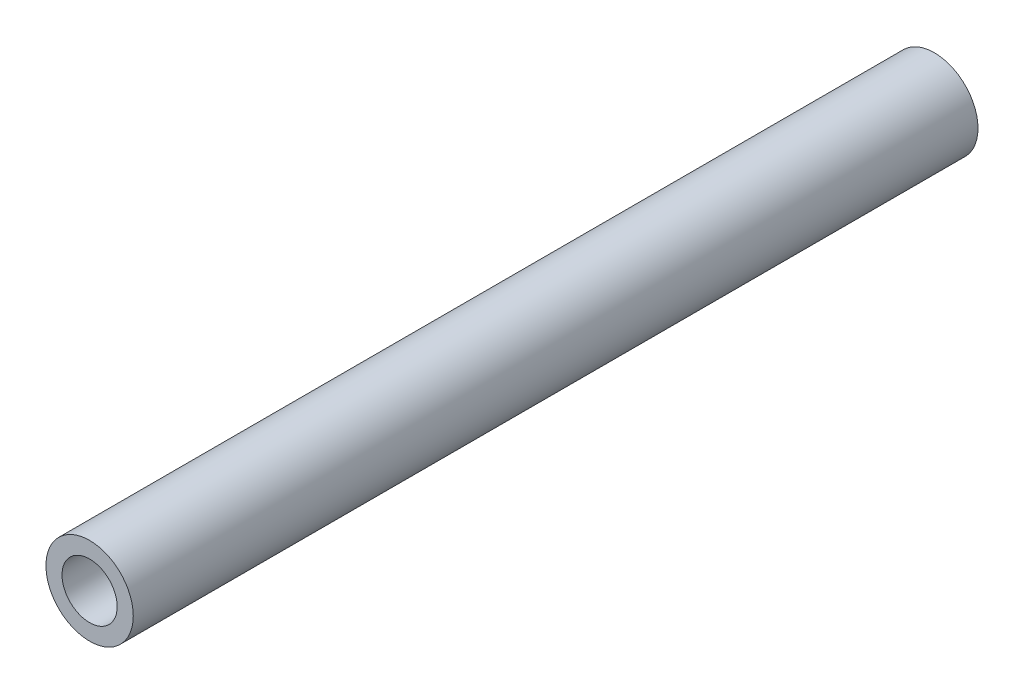
ISO-10303-21;
HEADER;
FILE_DESCRIPTION(('STEP AP214'),'2;1');
FILE_NAME('part.step','',(''),(''),'','','');
FILE_SCHEMA(('AUTOMOTIVE_DESIGN { 1 0 10303 214 1 1 1 1 }'));
ENDSEC;
DATA;
#1=APPLICATION_CONTEXT('core data for automotive mechanical design processes');
#2=APPLICATION_PROTOCOL_DEFINITION('international standard','automotive_design',2000,#1);
#3=PRODUCT_CONTEXT('',#1,'mechanical');
#4=PRODUCT('Part','Part','',(#3));
#5=PRODUCT_RELATED_PRODUCT_CATEGORY('part','',(#4));
#6=PRODUCT_DEFINITION_FORMATION('','',#4);
#7=PRODUCT_DEFINITION_CONTEXT('part definition',#1,'design');
#8=PRODUCT_DEFINITION('design','',#6,#7);
#9=PRODUCT_DEFINITION_SHAPE('','',#8);
#10=(LENGTH_UNIT() NAMED_UNIT(*) SI_UNIT(.MILLI.,.METRE.));
#11=(NAMED_UNIT(*) PLANE_ANGLE_UNIT() SI_UNIT($,.RADIAN.));
#12=(NAMED_UNIT(*) SI_UNIT($,.STERADIAN.) SOLID_ANGLE_UNIT());
#13=UNCERTAINTY_MEASURE_WITH_UNIT(LENGTH_MEASURE(1.E-05),#10,'distance_accuracy_value','');
#14=(GEOMETRIC_REPRESENTATION_CONTEXT(3) GLOBAL_UNCERTAINTY_ASSIGNED_CONTEXT((#13)) GLOBAL_UNIT_ASSIGNED_CONTEXT((#10,
#11,#12)) REPRESENTATION_CONTEXT('',''));
#15=CARTESIAN_POINT('',(0.,0.,0.));
#16=DIRECTION('',(0.,0.,1.));
#17=DIRECTION('',(1.,0.,0.));
#18=AXIS2_PLACEMENT_3D('',#15,#16,#17);
#19=CARTESIAN_POINT('',(0.,0.,233.3625));
#20=DIRECTION('',(0.,0.,1.));
#21=DIRECTION('',(1.,0.,0.));
#22=AXIS2_PLACEMENT_3D('',#19,#20,#21);
#23=PLANE('',#22);
#24=CARTESIAN_POINT('',(0.,0.,233.3625));
#25=DIRECTION('',(0.,0.,1.));
#26=DIRECTION('',(1.,0.,0.));
#27=AXIS2_PLACEMENT_3D('',#24,#25,#26);
#28=CIRCLE('',#27,24.13);
#29=CARTESIAN_POINT('',(24.13,0.,233.3625));
#30=VERTEX_POINT('',#29);
#31=EDGE_CURVE('E10',#30,#30,#28,.T.);
#32=ORIENTED_EDGE('',*,*,#31,.T.);
#33=EDGE_LOOP('',(#32));
#34=FACE_BOUND('',#33,.T.);
#35=CARTESIAN_POINT('',(0.,0.,233.3625));
#36=DIRECTION('',(0.,0.,1.));
#37=DIRECTION('',(1.,0.,0.));
#38=AXIS2_PLACEMENT_3D('',#35,#36,#37);
#39=CIRCLE('',#38,15.24);
#40=CARTESIAN_POINT('',(15.24,0.,233.3625));
#41=VERTEX_POINT('',#40);
#42=EDGE_CURVE('E42',#41,#41,#39,.T.);
#43=ORIENTED_EDGE('',*,*,#42,.F.);
#44=EDGE_LOOP('',(#43));
#45=FACE_BOUND('',#44,.T.);
#46=ADVANCED_FACE('F31',(#34,#45),#23,.T.);
#47=CARTESIAN_POINT('',(0.,0.,-233.3625));
#48=DIRECTION('',(0.,0.,1.));
#49=DIRECTION('',(1.,0.,0.));
#50=AXIS2_PLACEMENT_3D('',#47,#48,#49);
#51=PLANE('',#50);
#52=CARTESIAN_POINT('',(0.,0.,-233.3625));
#53=DIRECTION('',(0.,0.,1.));
#54=DIRECTION('',(1.,0.,0.));
#55=AXIS2_PLACEMENT_3D('',#52,#53,#54);
#56=CIRCLE('',#55,24.13);
#57=CARTESIAN_POINT('',(24.13,0.,-233.3625));
#58=VERTEX_POINT('',#57);
#59=EDGE_CURVE('E35',#58,#58,#56,.T.);
#60=ORIENTED_EDGE('',*,*,#59,.F.);
#61=EDGE_LOOP('',(#60));
#62=FACE_BOUND('',#61,.T.);
#63=CARTESIAN_POINT('',(0.,0.,-233.3625));
#64=DIRECTION('',(0.,0.,1.));
#65=DIRECTION('',(1.,0.,0.));
#66=AXIS2_PLACEMENT_3D('',#63,#64,#65);
#67=CIRCLE('',#66,15.24);
#68=CARTESIAN_POINT('',(15.24,0.,-233.3625));
#69=VERTEX_POINT('',#68);
#70=EDGE_CURVE('E44',#69,#69,#67,.T.);
#71=ORIENTED_EDGE('',*,*,#70,.T.);
#72=EDGE_LOOP('',(#71));
#73=FACE_BOUND('',#72,.T.);
#74=ADVANCED_FACE('F54',(#62,#73),#51,.F.);
#75=CARTESIAN_POINT('',(0.,0.,233.3625));
#76=DIRECTION('',(0.,0.,-1.));
#77=DIRECTION('',(-1.,0.,0.));
#78=AXIS2_PLACEMENT_3D('',#75,#76,#77);
#79=CYLINDRICAL_SURFACE('',#78,24.13);
#80=ORIENTED_EDGE('',*,*,#31,.F.);
#81=EDGE_LOOP('',(#80));
#82=FACE_BOUND('',#81,.T.);
#83=ORIENTED_EDGE('',*,*,#59,.T.);
#84=EDGE_LOOP('',(#83));
#85=FACE_BOUND('',#84,.T.);
#86=ADVANCED_FACE('F33',(#82,#85),#79,.T.);
#87=CARTESIAN_POINT('',(0.,0.,233.3625));
#88=DIRECTION('',(0.,0.,-1.));
#89=DIRECTION('',(-1.,0.,0.));
#90=AXIS2_PLACEMENT_3D('',#87,#88,#89);
#91=CYLINDRICAL_SURFACE('',#90,15.24);
#92=ORIENTED_EDGE('',*,*,#42,.T.);
#93=EDGE_LOOP('',(#92));
#94=FACE_BOUND('',#93,.T.);
#95=ORIENTED_EDGE('',*,*,#70,.F.);
#96=EDGE_LOOP('',(#95));
#97=FACE_BOUND('',#96,.T.);
#98=ADVANCED_FACE('F50',(#94,#97),#91,.F.);
#99=CLOSED_SHELL('',(#46,#74,#86,#98));
#100=MANIFOLD_SOLID_BREP('B2',#99);
#101=ADVANCED_BREP_SHAPE_REPRESENTATION('',(#18,#100),#14);
#102=SHAPE_DEFINITION_REPRESENTATION(#9,#101);
ENDSEC;
END-ISO-10303-21;
